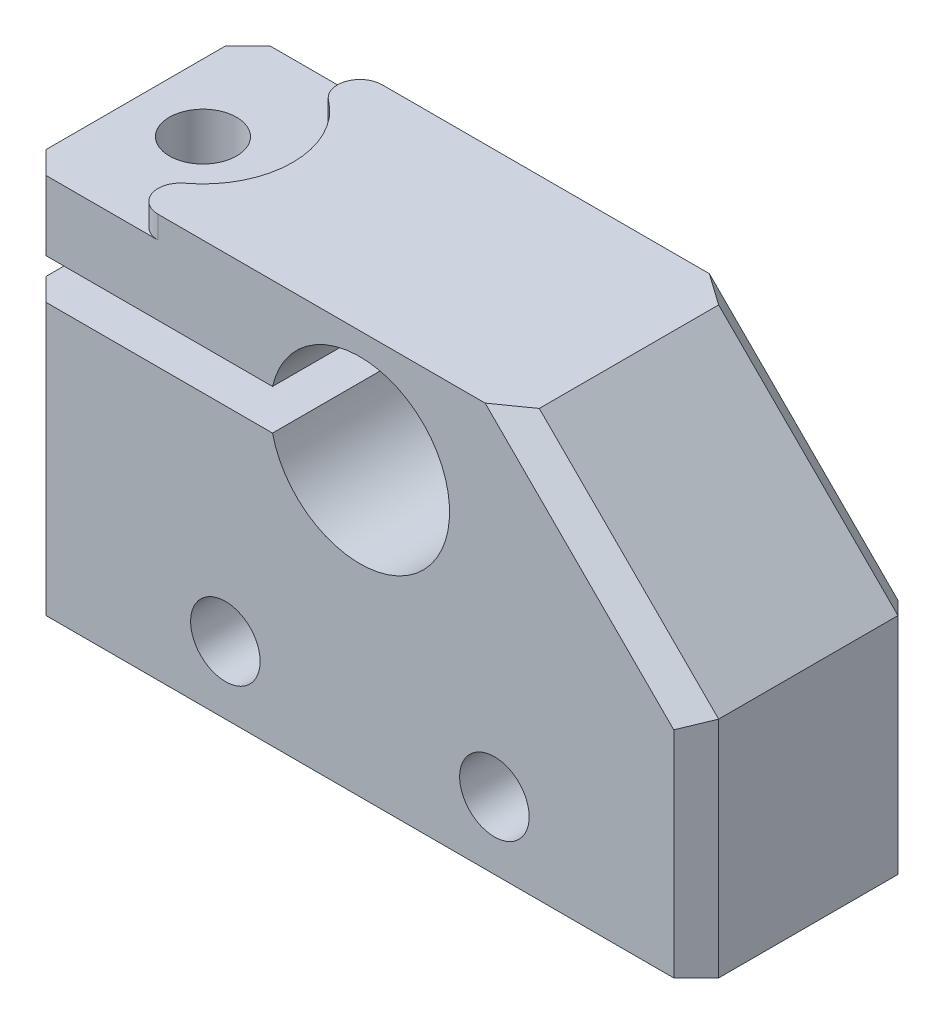
ISO-10303-21;
HEADER;
FILE_DESCRIPTION(('STEP AP214'),'2;1');
FILE_NAME('part.step','',(''),(''),'','','');
FILE_SCHEMA(('AUTOMOTIVE_DESIGN { 1 0 10303 214 1 1 1 1 }'));
ENDSEC;
DATA;
#1=APPLICATION_CONTEXT('core data for automotive mechanical design processes');
#2=APPLICATION_PROTOCOL_DEFINITION('international standard','automotive_design',2000,#1);
#3=PRODUCT_CONTEXT('',#1,'mechanical');
#4=PRODUCT('Part','Part','',(#3));
#5=PRODUCT_RELATED_PRODUCT_CATEGORY('part','',(#4));
#6=PRODUCT_DEFINITION_FORMATION('','',#4);
#7=PRODUCT_DEFINITION_CONTEXT('part definition',#1,'design');
#8=PRODUCT_DEFINITION('design','',#6,#7);
#9=PRODUCT_DEFINITION_SHAPE('','',#8);
#10=(LENGTH_UNIT() NAMED_UNIT(*) SI_UNIT(.MILLI.,.METRE.));
#11=(NAMED_UNIT(*) PLANE_ANGLE_UNIT() SI_UNIT($,.RADIAN.));
#12=(NAMED_UNIT(*) SI_UNIT($,.STERADIAN.) SOLID_ANGLE_UNIT());
#13=UNCERTAINTY_MEASURE_WITH_UNIT(LENGTH_MEASURE(1.E-05),#10,'distance_accuracy_value','');
#14=(GEOMETRIC_REPRESENTATION_CONTEXT(3) GLOBAL_UNCERTAINTY_ASSIGNED_CONTEXT((#13)) GLOBAL_UNIT_ASSIGNED_CONTEXT((#10,
#11,#12)) REPRESENTATION_CONTEXT('',''));
#15=CARTESIAN_POINT('',(0.,0.,0.));
#16=DIRECTION('',(0.,0.,1.));
#17=DIRECTION('',(1.,0.,0.));
#18=AXIS2_PLACEMENT_3D('',#15,#16,#17);
#19=CARTESIAN_POINT('',(-15.,-4.,5.));
#20=DIRECTION('',(1.,0.,0.));
#21=DIRECTION('',(0.,0.,-1.));
#22=AXIS2_PLACEMENT_3D('',#19,#20,#21);
#23=PLANE('',#22);
#24=DIRECTION('',(0.,0.,1.));
#25=VECTOR('',#24,1.);
#26=CARTESIAN_POINT('',(-15.,13.,-5.));
#27=LINE('',#26,#25);
#28=CARTESIAN_POINT('',(-15.,13.,-4.));
#29=VERTEX_POINT('',#28);
#30=CARTESIAN_POINT('',(-15.,13.,4.));
#31=VERTEX_POINT('',#30);
#32=EDGE_CURVE('E214',#29,#31,#27,.T.);
#33=ORIENTED_EDGE('',*,*,#32,.F.);
#34=DIRECTION('',(0.,-1.,0.));
#35=VECTOR('',#34,1.);
#36=CARTESIAN_POINT('',(-15.,9.9,-4.));
#37=LINE('',#36,#35);
#38=CARTESIAN_POINT('',(-15.,9.9,-4.));
#39=VERTEX_POINT('',#38);
#40=EDGE_CURVE('E334',#29,#39,#37,.T.);
#41=ORIENTED_EDGE('',*,*,#40,.T.);
#42=DIRECTION('',(0.,0.,1.));
#43=VECTOR('',#42,1.);
#44=CARTESIAN_POINT('',(-15.,9.9,-5.));
#45=LINE('',#44,#43);
#46=CARTESIAN_POINT('',(-15.,9.9,4.));
#47=VERTEX_POINT('',#46);
#48=EDGE_CURVE('E250',#39,#47,#45,.T.);
#49=ORIENTED_EDGE('',*,*,#48,.T.);
#50=DIRECTION('',(0.,1.,0.));
#51=VECTOR('',#50,1.);
#52=CARTESIAN_POINT('',(-15.,-4.,4.));
#53=LINE('',#52,#51);
#54=EDGE_CURVE('E332',#47,#31,#53,.T.);
#55=ORIENTED_EDGE('',*,*,#54,.T.);
#56=EDGE_LOOP('',(#33,#41,#49,#55));
#57=FACE_BOUND('',#56,.T.);
#58=ADVANCED_FACE('F45',(#57),#23,.F.);
#59=CARTESIAN_POINT('',(-12.,-4.00000000000001,0.));
#60=DIRECTION('',(0.,1.,0.));
#61=DIRECTION('',(-1.,0.,0.));
#62=AXIS2_PLACEMENT_3D('',#59,#60,#61);
#63=CYLINDRICAL_SURFACE('',#62,1.5);
#64=CARTESIAN_POINT('',(-12.,9.9,0.));
#65=DIRECTION('',(0.,1.,0.));
#66=DIRECTION('',(0.,0.,1.));
#67=AXIS2_PLACEMENT_3D('',#64,#65,#66);
#68=CIRCLE('',#67,1.5);
#69=CARTESIAN_POINT('',(-12.,9.9,1.5));
#70=VERTEX_POINT('',#69);
#71=EDGE_CURVE('E241',#70,#70,#68,.T.);
#72=ORIENTED_EDGE('',*,*,#71,.F.);
#73=EDGE_LOOP('',(#72));
#74=FACE_BOUND('',#73,.T.);
#75=CARTESIAN_POINT('',(-12.,13.,0.));
#76=DIRECTION('',(0.,1.,0.));
#77=DIRECTION('',(-1.,0.,0.));
#78=AXIS2_PLACEMENT_3D('',#75,#76,#77);
#79=CIRCLE('',#78,1.5);
#80=CARTESIAN_POINT('',(-13.5,13.,0.));
#81=VERTEX_POINT('',#80);
#82=EDGE_CURVE('E233',#81,#81,#79,.F.);
#83=ORIENTED_EDGE('',*,*,#82,.F.);
#84=EDGE_LOOP('',(#83));
#85=FACE_BOUND('',#84,.T.);
#86=ADVANCED_FACE('F445',(#74,#85),#63,.F.);
#87=DIRECTION('',(0.,0.,1.));
#88=VECTOR('',#87,1.);
#89=CARTESIAN_POINT('',(-15.,8.1,-5.));
#90=LINE('',#89,#88);
#91=CARTESIAN_POINT('',(-15.,8.1,-4.));
#92=VERTEX_POINT('',#91);
#93=CARTESIAN_POINT('',(-15.,8.1,4.));
#94=VERTEX_POINT('',#93);
#95=EDGE_CURVE('E251',#92,#94,#90,.T.);
#96=ORIENTED_EDGE('',*,*,#95,.F.);
#97=DIRECTION('',(0.,-1.,0.));
#98=VECTOR('',#97,1.);
#99=CARTESIAN_POINT('',(-15.,-4.,-4.));
#100=LINE('',#99,#98);
#101=CARTESIAN_POINT('',(-15.,-4.,-4.));
#102=VERTEX_POINT('',#101);
#103=EDGE_CURVE('E310',#92,#102,#100,.T.);
#104=ORIENTED_EDGE('',*,*,#103,.T.);
#105=DIRECTION('',(0.,0.,-1.));
#106=VECTOR('',#105,1.);
#107=CARTESIAN_POINT('',(-15.,-4.,5.));
#108=LINE('',#107,#106);
#109=CARTESIAN_POINT('',(-15.,-4.,4.));
#110=VERTEX_POINT('',#109);
#111=EDGE_CURVE('E296',#110,#102,#108,.T.);
#112=ORIENTED_EDGE('',*,*,#111,.F.);
#113=DIRECTION('',(0.,1.,0.));
#114=VECTOR('',#113,1.);
#115=CARTESIAN_POINT('',(-15.,-4.,4.));
#116=LINE('',#115,#114);
#117=EDGE_CURVE('E304',#110,#94,#116,.T.);
#118=ORIENTED_EDGE('',*,*,#117,.T.);
#119=EDGE_LOOP('',(#96,#104,#112,#118));
#120=FACE_BOUND('',#119,.T.);
#121=ADVANCED_FACE('F412',(#120),#23,.F.);
#122=CARTESIAN_POINT('',(0.,0.,5.));
#123=DIRECTION('',(0.,0.,-1.));
#124=DIRECTION('',(-1.,0.,0.));
#125=AXIS2_PLACEMENT_3D('',#122,#123,#124);
#126=PLANE('',#125);
#127=DIRECTION('',(1.,0.,0.));
#128=VECTOR('',#127,1.);
#129=CARTESIAN_POINT('',(-15.,13.,5.));
#130=LINE('',#129,#128);
#131=CARTESIAN_POINT('',(-14.,13.,5.));
#132=VERTEX_POINT('',#131);
#133=CARTESIAN_POINT('',(-9.,13.,5.));
#134=VERTEX_POINT('',#133);
#135=EDGE_CURVE('E217',#132,#134,#130,.T.);
#136=ORIENTED_EDGE('',*,*,#135,.F.);
#137=DIRECTION('',(0.,-1.,0.));
#138=VECTOR('',#137,1.);
#139=CARTESIAN_POINT('',(-14.,0.,5.));
#140=LINE('',#139,#138);
#141=CARTESIAN_POINT('',(-14.,9.9,5.));
#142=VERTEX_POINT('',#141);
#143=EDGE_CURVE('E353',#132,#142,#140,.T.);
#144=ORIENTED_EDGE('',*,*,#143,.T.);
#145=DIRECTION('',(1.,0.,0.));
#146=VECTOR('',#145,1.);
#147=CARTESIAN_POINT('',(0.,9.9,5.));
#148=LINE('',#147,#146);
#149=CARTESIAN_POINT('',(-3.89743505398102,9.9,5.));
#150=VERTEX_POINT('',#149);
#151=EDGE_CURVE('E258',#142,#150,#148,.T.);
#152=ORIENTED_EDGE('',*,*,#151,.T.);
#153=CARTESIAN_POINT('',(0.,9.,5.));
#154=DIRECTION('',(0.,0.,1.));
#155=DIRECTION('',(1.,0.,0.));
#156=AXIS2_PLACEMENT_3D('',#153,#154,#155);
#157=CIRCLE('',#156,4.);
#158=CARTESIAN_POINT('',(-3.89743505398102,8.1,5.));
#159=VERTEX_POINT('',#158);
#160=EDGE_CURVE('E264',#159,#150,#157,.T.);
#161=ORIENTED_EDGE('',*,*,#160,.F.);
#162=DIRECTION('',(1.,0.,0.));
#163=VECTOR('',#162,1.);
#164=CARTESIAN_POINT('',(0.,8.1,5.));
#165=LINE('',#164,#163);
#166=CARTESIAN_POINT('',(-14.,8.1,5.));
#167=VERTEX_POINT('',#166);
#168=EDGE_CURVE('E254',#167,#159,#165,.T.);
#169=ORIENTED_EDGE('',*,*,#168,.F.);
#170=DIRECTION('',(0.,-1.,0.));
#171=VECTOR('',#170,1.);
#172=CARTESIAN_POINT('',(-14.,0.,5.));
#173=LINE('',#172,#171);
#174=CARTESIAN_POINT('',(-14.,-4.,5.));
#175=VERTEX_POINT('',#174);
#176=EDGE_CURVE('E350',#167,#175,#173,.T.);
#177=ORIENTED_EDGE('',*,*,#176,.T.);
#178=DIRECTION('',(1.,0.,0.));
#179=VECTOR('',#178,1.);
#180=CARTESIAN_POINT('',(-15.,-4.,5.));
#181=LINE('',#180,#179);
#182=CARTESIAN_POINT('',(14.,-4.,5.));
#183=VERTEX_POINT('',#182);
#184=EDGE_CURVE('E288',#175,#183,#181,.T.);
#185=ORIENTED_EDGE('',*,*,#184,.T.);
#186=DIRECTION('',(0.,1.,0.));
#187=VECTOR('',#186,1.);
#188=CARTESIAN_POINT('',(14.,0.,5.));
#189=LINE('',#188,#187);
#190=CARTESIAN_POINT('',(14.,5.5857864376269,5.));
#191=VERTEX_POINT('',#190);
#192=EDGE_CURVE('E345',#183,#191,#189,.T.);
#193=ORIENTED_EDGE('',*,*,#192,.T.);
#194=DIRECTION('',(-0.707106781186551,0.707106781186544,0.));
#195=VECTOR('',#194,1.);
#196=CARTESIAN_POINT('',(6.29289321881336,13.2928932188134,5.));
#197=LINE('',#196,#195);
#198=CARTESIAN_POINT('',(5.5857864376268,14.,5.));
#199=VERTEX_POINT('',#198);
#200=EDGE_CURVE('E347',#191,#199,#197,.T.);
#201=ORIENTED_EDGE('',*,*,#200,.T.);
#202=DIRECTION('',(-1.,0.,0.));
#203=VECTOR('',#202,1.);
#204=CARTESIAN_POINT('',(6.99999999999991,14.,5.));
#205=LINE('',#204,#203);
#206=CARTESIAN_POINT('',(-9.00000000000001,14.,5.));
#207=VERTEX_POINT('',#206);
#208=EDGE_CURVE('E261',#199,#207,#205,.T.);
#209=ORIENTED_EDGE('',*,*,#208,.T.);
#210=DIRECTION('',(0.,1.,0.));
#211=VECTOR('',#210,1.);
#212=CARTESIAN_POINT('',(-9.,13.,5.));
#213=LINE('',#212,#211);
#214=EDGE_CURVE('E195',#134,#207,#213,.T.);
#215=ORIENTED_EDGE('',*,*,#214,.F.);
#216=EDGE_LOOP('',(#136,#144,#152,#161,#169,#177,#185,#193,#201,#209,#215));
#217=FACE_BOUND('',#216,.T.);
#218=CARTESIAN_POINT('',(-6.,-1.,5.));
#219=DIRECTION('',(0.,0.,1.));
#220=DIRECTION('',(1.,0.,0.));
#221=AXIS2_PLACEMENT_3D('',#218,#219,#220);
#222=CIRCLE('',#221,1.55);
#223=CARTESIAN_POINT('',(-4.45,-1.,5.));
#224=VERTEX_POINT('',#223);
#225=EDGE_CURVE('E282',#224,#224,#222,.T.);
#226=ORIENTED_EDGE('',*,*,#225,.F.);
#227=EDGE_LOOP('',(#226));
#228=FACE_BOUND('',#227,.T.);
#229=CARTESIAN_POINT('',(6.,-0.999999999999999,5.));
#230=DIRECTION('',(0.,0.,1.));
#231=DIRECTION('',(1.,0.,0.));
#232=AXIS2_PLACEMENT_3D('',#229,#230,#231);
#233=CIRCLE('',#232,1.55);
#234=CARTESIAN_POINT('',(7.55,-0.999999999999999,5.));
#235=VERTEX_POINT('',#234);
#236=EDGE_CURVE('E276',#235,#235,#233,.T.);
#237=ORIENTED_EDGE('',*,*,#236,.F.);
#238=EDGE_LOOP('',(#237));
#239=FACE_BOUND('',#238,.T.);
#240=ADVANCED_FACE('F402',(#217,#228,#239),#126,.F.);
#241=CARTESIAN_POINT('',(0.,0.,-5.));
#242=DIRECTION('',(0.,0.,-1.));
#243=DIRECTION('',(-1.,0.,0.));
#244=AXIS2_PLACEMENT_3D('',#241,#242,#243);
#245=PLANE('',#244);
#246=DIRECTION('',(1.,0.,0.));
#247=VECTOR('',#246,1.);
#248=CARTESIAN_POINT('',(-15.,-4.,-5.));
#249=LINE('',#248,#247);
#250=CARTESIAN_POINT('',(-14.,-4.,-5.));
#251=VERTEX_POINT('',#250);
#252=CARTESIAN_POINT('',(14.,-4.,-5.));
#253=VERTEX_POINT('',#252);
#254=EDGE_CURVE('E285',#251,#253,#249,.T.);
#255=ORIENTED_EDGE('',*,*,#254,.F.);
#256=DIRECTION('',(0.,1.,0.));
#257=VECTOR('',#256,1.);
#258=CARTESIAN_POINT('',(-14.,8.1,-5.));
#259=LINE('',#258,#257);
#260=CARTESIAN_POINT('',(-14.,8.1,-5.));
#261=VERTEX_POINT('',#260);
#262=EDGE_CURVE('E326',#251,#261,#259,.T.);
#263=ORIENTED_EDGE('',*,*,#262,.T.);
#264=DIRECTION('',(1.,0.,0.));
#265=VECTOR('',#264,1.);
#266=CARTESIAN_POINT('',(0.,8.1,-5.));
#267=LINE('',#266,#265);
#268=CARTESIAN_POINT('',(-3.89743505398102,8.1,-5.));
#269=VERTEX_POINT('',#268);
#270=EDGE_CURVE('E247',#269,#261,#267,.F.);
#271=ORIENTED_EDGE('',*,*,#270,.F.);
#272=CARTESIAN_POINT('',(0.,9.,-5.));
#273=DIRECTION('',(0.,0.,-1.));
#274=DIRECTION('',(-1.,0.,0.));
#275=AXIS2_PLACEMENT_3D('',#272,#273,#274);
#276=CIRCLE('',#275,4.);
#277=CARTESIAN_POINT('',(-3.89743505398102,9.9,-5.));
#278=VERTEX_POINT('',#277);
#279=EDGE_CURVE('E263',#269,#278,#276,.F.);
#280=ORIENTED_EDGE('',*,*,#279,.T.);
#281=DIRECTION('',(1.,0.,0.));
#282=VECTOR('',#281,1.);
#283=CARTESIAN_POINT('',(0.,9.9,-5.));
#284=LINE('',#283,#282);
#285=CARTESIAN_POINT('',(-14.,9.9,-5.));
#286=VERTEX_POINT('',#285);
#287=EDGE_CURVE('E245',#278,#286,#284,.F.);
#288=ORIENTED_EDGE('',*,*,#287,.T.);
#289=DIRECTION('',(0.,1.,0.));
#290=VECTOR('',#289,1.);
#291=CARTESIAN_POINT('',(-14.,13.,-5.));
#292=LINE('',#291,#290);
#293=CARTESIAN_POINT('',(-14.,13.,-5.));
#294=VERTEX_POINT('',#293);
#295=EDGE_CURVE('E213',#286,#294,#292,.T.);
#296=ORIENTED_EDGE('',*,*,#295,.T.);
#297=DIRECTION('',(-1.,0.,0.));
#298=VECTOR('',#297,1.);
#299=CARTESIAN_POINT('',(-9.,13.,-5.));
#300=LINE('',#299,#298);
#301=CARTESIAN_POINT('',(-9.,13.,-5.));
#302=VERTEX_POINT('',#301);
#303=EDGE_CURVE('E202',#302,#294,#300,.T.);
#304=ORIENTED_EDGE('',*,*,#303,.F.);
#305=DIRECTION('',(0.,1.,0.));
#306=VECTOR('',#305,1.);
#307=CARTESIAN_POINT('',(-9.,13.,-5.));
#308=LINE('',#307,#306);
#309=CARTESIAN_POINT('',(-9.,14.,-5.));
#310=VERTEX_POINT('',#309);
#311=EDGE_CURVE('E185',#302,#310,#308,.T.);
#312=ORIENTED_EDGE('',*,*,#311,.T.);
#313=DIRECTION('',(-1.,0.,0.));
#314=VECTOR('',#313,1.);
#315=CARTESIAN_POINT('',(6.99999999999991,14.,-5.));
#316=LINE('',#315,#314);
#317=CARTESIAN_POINT('',(5.5857864376268,14.,-5.));
#318=VERTEX_POINT('',#317);
#319=EDGE_CURVE('E260',#318,#310,#316,.T.);
#320=ORIENTED_EDGE('',*,*,#319,.F.);
#321=DIRECTION('',(0.707106781186551,-0.707106781186544,0.));
#322=VECTOR('',#321,1.);
#323=CARTESIAN_POINT('',(9.79289321881337,9.79289321881348,-5.));
#324=LINE('',#323,#322);
#325=CARTESIAN_POINT('',(14.,5.58578643762691,-5.));
#326=VERTEX_POINT('',#325);
#327=EDGE_CURVE('E321',#318,#326,#324,.T.);
#328=ORIENTED_EDGE('',*,*,#327,.T.);
#329=DIRECTION('',(0.,-1.,0.));
#330=VECTOR('',#329,1.);
#331=CARTESIAN_POINT('',(14.,-4.,-5.));
#332=LINE('',#331,#330);
#333=EDGE_CURVE('E323',#326,#253,#332,.T.);
#334=ORIENTED_EDGE('',*,*,#333,.T.);
#335=EDGE_LOOP('',(#255,#263,#271,#280,#288,#296,#304,#312,#320,#328,#334));
#336=FACE_BOUND('',#335,.T.);
#337=CARTESIAN_POINT('',(-6.,-1.,-5.));
#338=DIRECTION('',(0.,0.,1.));
#339=DIRECTION('',(1.,0.,0.));
#340=AXIS2_PLACEMENT_3D('',#337,#338,#339);
#341=CIRCLE('',#340,1.55);
#342=CARTESIAN_POINT('',(-4.45,-1.,-5.));
#343=VERTEX_POINT('',#342);
#344=EDGE_CURVE('E279',#343,#343,#341,.T.);
#345=ORIENTED_EDGE('',*,*,#344,.T.);
#346=EDGE_LOOP('',(#345));
#347=FACE_BOUND('',#346,.T.);
#348=CARTESIAN_POINT('',(6.,-0.999999999999999,-5.));
#349=DIRECTION('',(0.,0.,1.));
#350=DIRECTION('',(1.,0.,0.));
#351=AXIS2_PLACEMENT_3D('',#348,#349,#350);
#352=CIRCLE('',#351,1.55);
#353=CARTESIAN_POINT('',(7.55,-0.999999999999999,-5.));
#354=VERTEX_POINT('',#353);
#355=EDGE_CURVE('E270',#354,#354,#352,.T.);
#356=ORIENTED_EDGE('',*,*,#355,.T.);
#357=EDGE_LOOP('',(#356));
#358=FACE_BOUND('',#357,.T.);
#359=ADVANCED_FACE('F209',(#336,#347,#358),#245,.T.);
#360=CARTESIAN_POINT('',(15.,-4.,5.));
#361=DIRECTION('',(-1.,0.,0.));
#362=DIRECTION('',(0.,0.,1.));
#363=AXIS2_PLACEMENT_3D('',#360,#361,#362);
#364=PLANE('',#363);
#365=DIRECTION('',(0.,0.,-1.));
#366=VECTOR('',#365,1.);
#367=CARTESIAN_POINT('',(15.,-4.,5.));
#368=LINE('',#367,#366);
#369=CARTESIAN_POINT('',(15.,-4.,3.99999999999999));
#370=VERTEX_POINT('',#369);
#371=CARTESIAN_POINT('',(15.,-4.,-4.));
#372=VERTEX_POINT('',#371);
#373=EDGE_CURVE('E291',#370,#372,#368,.T.);
#374=ORIENTED_EDGE('',*,*,#373,.T.);
#375=DIRECTION('',(0.,1.,0.));
#376=VECTOR('',#375,1.);
#377=CARTESIAN_POINT('',(15.,6.,-4.));
#378=LINE('',#377,#376);
#379=CARTESIAN_POINT('',(15.,6.,-4.));
#380=VERTEX_POINT('',#379);
#381=EDGE_CURVE('E358',#372,#380,#378,.T.);
#382=ORIENTED_EDGE('',*,*,#381,.T.);
#383=DIRECTION('',(0.,0.,1.));
#384=VECTOR('',#383,1.);
#385=CARTESIAN_POINT('',(15.,6.,-36.6227766016838));
#386=LINE('',#385,#384);
#387=CARTESIAN_POINT('',(15.,6.,3.99999999999999));
#388=VERTEX_POINT('',#387);
#389=EDGE_CURVE('E267',#380,#388,#386,.T.);
#390=ORIENTED_EDGE('',*,*,#389,.T.);
#391=DIRECTION('',(0.,-1.,0.));
#392=VECTOR('',#391,1.);
#393=CARTESIAN_POINT('',(15.,-4.,3.99999999999999));
#394=LINE('',#393,#392);
#395=EDGE_CURVE('E356',#388,#370,#394,.T.);
#396=ORIENTED_EDGE('',*,*,#395,.T.);
#397=EDGE_LOOP('',(#374,#382,#390,#396));
#398=FACE_BOUND('',#397,.T.);
#399=ADVANCED_FACE('F380',(#398),#364,.F.);
#400=CARTESIAN_POINT('',(-15.,-4.,5.));
#401=DIRECTION('',(0.,1.,0.));
#402=DIRECTION('',(0.,0.,1.));
#403=AXIS2_PLACEMENT_3D('',#400,#401,#402);
#404=PLANE('',#403);
#405=CARTESIAN_POINT('',(-12.,-4.00000000000001,0.));
#406=DIRECTION('',(0.,1.,0.));
#407=DIRECTION('',(-1.,0.,0.));
#408=AXIS2_PLACEMENT_3D('',#405,#406,#407);
#409=CIRCLE('',#408,1.5);
#410=CARTESIAN_POINT('',(-13.5,-4.00000000000001,0.));
#411=VERTEX_POINT('',#410);
#412=EDGE_CURVE('E238',#411,#411,#409,.T.);
#413=ORIENTED_EDGE('',*,*,#412,.T.);
#414=EDGE_LOOP('',(#413));
#415=FACE_BOUND('',#414,.T.);
#416=ORIENTED_EDGE('',*,*,#111,.T.);
#417=DIRECTION('',(0.707106781186549,0.,-0.707106781186546));
#418=VECTOR('',#417,1.);
#419=CARTESIAN_POINT('',(-15.,-4.,-4.));
#420=LINE('',#419,#418);
#421=EDGE_CURVE('E319',#102,#251,#420,.T.);
#422=ORIENTED_EDGE('',*,*,#421,.T.);
#423=ORIENTED_EDGE('',*,*,#254,.T.);
#424=DIRECTION('',(0.707106781186549,0.,0.707106781186546));
#425=VECTOR('',#424,1.);
#426=CARTESIAN_POINT('',(15.,-4.,-4.));
#427=LINE('',#426,#425);
#428=EDGE_CURVE('E315',#253,#372,#427,.T.);
#429=ORIENTED_EDGE('',*,*,#428,.T.);
#430=ORIENTED_EDGE('',*,*,#373,.F.);
#431=DIRECTION('',(0.707106781186546,0.,-0.707106781186549));
#432=VECTOR('',#431,1.);
#433=CARTESIAN_POINT('',(14.,-4.,5.));
#434=LINE('',#433,#432);
#435=EDGE_CURVE('E313',#370,#183,#434,.F.);
#436=ORIENTED_EDGE('',*,*,#435,.T.);
#437=ORIENTED_EDGE('',*,*,#184,.F.);
#438=DIRECTION('',(0.707106781186548,0.,0.707106781186548));
#439=VECTOR('',#438,1.);
#440=CARTESIAN_POINT('',(-14.,-4.,5.));
#441=LINE('',#440,#439);
#442=EDGE_CURVE('E317',#175,#110,#441,.F.);
#443=ORIENTED_EDGE('',*,*,#442,.T.);
#444=EDGE_LOOP('',(#416,#422,#423,#429,#430,#436,#437,#443));
#445=FACE_BOUND('',#444,.T.);
#446=ADVANCED_FACE('F382',(#415,#445),#404,.F.);
#447=CARTESIAN_POINT('',(-6.,-1.,5.));
#448=DIRECTION('',(0.,0.,-1.));
#449=DIRECTION('',(-1.,0.,0.));
#450=AXIS2_PLACEMENT_3D('',#447,#448,#449);
#451=CYLINDRICAL_SURFACE('',#450,1.55);
#452=ORIENTED_EDGE('',*,*,#225,.T.);
#453=EDGE_LOOP('',(#452));
#454=FACE_BOUND('',#453,.T.);
#455=ORIENTED_EDGE('',*,*,#344,.F.);
#456=EDGE_LOOP('',(#455));
#457=FACE_BOUND('',#456,.T.);
#458=ADVANCED_FACE('F466',(#454,#457),#451,.F.);
#459=CARTESIAN_POINT('',(6.,-0.999999999999999,5.));
#460=DIRECTION('',(0.,0.,-1.));
#461=DIRECTION('',(-1.,0.,0.));
#462=AXIS2_PLACEMENT_3D('',#459,#460,#461);
#463=CYLINDRICAL_SURFACE('',#462,1.55);
#464=ORIENTED_EDGE('',*,*,#236,.T.);
#465=EDGE_LOOP('',(#464));
#466=FACE_BOUND('',#465,.T.);
#467=ORIENTED_EDGE('',*,*,#355,.F.);
#468=EDGE_LOOP('',(#467));
#469=FACE_BOUND('',#468,.T.);
#470=ADVANCED_FACE('F475',(#466,#469),#463,.F.);
#471=CARTESIAN_POINT('',(6.99999999999991,14.,-36.6227766016838));
#472=DIRECTION('',(0.,1.,0.));
#473=DIRECTION('',(-1.,0.,0.));
#474=AXIS2_PLACEMENT_3D('',#471,#472,#473);
#475=PLANE('',#474);
#476=DIRECTION('',(0.,0.,1.));
#477=VECTOR('',#476,1.);
#478=CARTESIAN_POINT('',(6.99999999999991,14.,-36.6227766016838));
#479=LINE('',#478,#477);
#480=CARTESIAN_POINT('',(6.99999999999991,14.,-4.));
#481=VERTEX_POINT('',#480);
#482=CARTESIAN_POINT('',(6.99999999999991,14.,3.99999999999999));
#483=VERTEX_POINT('',#482);
#484=EDGE_CURVE('E272',#481,#483,#479,.T.);
#485=ORIENTED_EDGE('',*,*,#484,.F.);
#486=DIRECTION('',(0.816496580927729,0.,0.577350269189622));
#487=VECTOR('',#486,1.);
#488=CARTESIAN_POINT('',(-8.37852437078967,14.,-14.8742588672278));
#489=LINE('',#488,#487);
#490=EDGE_CURVE('E11',#481,#318,#489,.F.);
#491=ORIENTED_EDGE('',*,*,#490,.T.);
#492=ORIENTED_EDGE('',*,*,#319,.T.);
#493=CARTESIAN_POINT('',(-9.,14.,-4.));
#494=DIRECTION('',(0.,-1.,0.));
#495=DIRECTION('',(-1.,0.,0.));
#496=AXIS2_PLACEMENT_3D('',#493,#494,#495);
#497=CIRCLE('',#496,1.);
#498=CARTESIAN_POINT('',(-9.6,14.,-3.2));
#499=VERTEX_POINT('',#498);
#500=EDGE_CURVE('E191',#499,#310,#497,.T.);
#501=ORIENTED_EDGE('',*,*,#500,.F.);
#502=CARTESIAN_POINT('',(-12.,14.,0.));
#503=DIRECTION('',(0.,1.,0.));
#504=DIRECTION('',(1.,0.,0.));
#505=AXIS2_PLACEMENT_3D('',#502,#503,#504);
#506=CIRCLE('',#505,4.);
#507=CARTESIAN_POINT('',(-9.6,14.,3.2));
#508=VERTEX_POINT('',#507);
#509=EDGE_CURVE('E206',#508,#499,#506,.T.);
#510=ORIENTED_EDGE('',*,*,#509,.F.);
#511=CARTESIAN_POINT('',(-9.,14.,4.));
#512=DIRECTION('',(0.,-1.,0.));
#513=DIRECTION('',(-1.,0.,0.));
#514=AXIS2_PLACEMENT_3D('',#511,#512,#513);
#515=CIRCLE('',#514,1.);
#516=EDGE_CURVE('E225',#207,#508,#515,.T.);
#517=ORIENTED_EDGE('',*,*,#516,.F.);
#518=ORIENTED_EDGE('',*,*,#208,.F.);
#519=DIRECTION('',(0.816496580927726,0.,-0.577350269189626));
#520=VECTOR('',#519,1.);
#521=CARTESIAN_POINT('',(26.1497605371178,14.,-9.54092553389462));
#522=LINE('',#521,#520);
#523=EDGE_CURVE('E55',#199,#483,#522,.T.);
#524=ORIENTED_EDGE('',*,*,#523,.T.);
#525=EDGE_LOOP('',(#485,#491,#492,#501,#510,#517,#518,#524));
#526=FACE_BOUND('',#525,.T.);
#527=ADVANCED_FACE('F388',(#526),#475,.T.);
#528=CARTESIAN_POINT('',(15.,6.,-36.6227766016838));
#529=DIRECTION('',(0.707106781186544,0.707106781186551,0.));
#530=DIRECTION('',(-0.707106781186551,0.707106781186544,0.));
#531=AXIS2_PLACEMENT_3D('',#528,#529,#530);
#532=PLANE('',#531);
#533=ORIENTED_EDGE('',*,*,#389,.F.);
#534=DIRECTION('',(-0.707106781186551,0.707106781186544,0.));
#535=VECTOR('',#534,1.);
#536=CARTESIAN_POINT('',(15.,6.,-4.));
#537=LINE('',#536,#535);
#538=EDGE_CURVE('E69',#380,#481,#537,.T.);
#539=ORIENTED_EDGE('',*,*,#538,.T.);
#540=ORIENTED_EDGE('',*,*,#484,.T.);
#541=DIRECTION('',(0.707106781186551,-0.707106781186544,0.));
#542=VECTOR('',#541,1.);
#543=CARTESIAN_POINT('',(15.,6.,3.99999999999999));
#544=LINE('',#543,#542);
#545=EDGE_CURVE('E361',#483,#388,#544,.T.);
#546=ORIENTED_EDGE('',*,*,#545,.T.);
#547=EDGE_LOOP('',(#533,#539,#540,#546));
#548=FACE_BOUND('',#547,.T.);
#549=ADVANCED_FACE('F386',(#548),#532,.T.);
#550=CARTESIAN_POINT('',(0.,9.,-36.6227766016838));
#551=DIRECTION('',(0.,0.,1.));
#552=DIRECTION('',(1.,0.,0.));
#553=AXIS2_PLACEMENT_3D('',#550,#551,#552);
#554=CYLINDRICAL_SURFACE('',#553,4.);
#555=ORIENTED_EDGE('',*,*,#160,.T.);
#556=DIRECTION('',(0.,0.,1.));
#557=VECTOR('',#556,1.);
#558=CARTESIAN_POINT('',(-3.89743505398102,9.9,-36.6227766016838));
#559=LINE('',#558,#557);
#560=EDGE_CURVE('E301',#150,#278,#559,.F.);
#561=ORIENTED_EDGE('',*,*,#560,.T.);
#562=ORIENTED_EDGE('',*,*,#279,.F.);
#563=DIRECTION('',(0.,0.,1.));
#564=VECTOR('',#563,1.);
#565=CARTESIAN_POINT('',(-3.89743505398102,8.1,-36.6227766016838));
#566=LINE('',#565,#564);
#567=EDGE_CURVE('E299',#159,#269,#566,.F.);
#568=ORIENTED_EDGE('',*,*,#567,.F.);
#569=EDGE_LOOP('',(#555,#561,#562,#568));
#570=FACE_BOUND('',#569,.T.);
#571=ADVANCED_FACE('F423',(#570),#554,.F.);
#572=CARTESIAN_POINT('',(0.,8.1,-5.));
#573=DIRECTION('',(0.,1.,0.));
#574=DIRECTION('',(0.,0.,1.));
#575=AXIS2_PLACEMENT_3D('',#572,#573,#574);
#576=PLANE('',#575);
#577=CARTESIAN_POINT('',(-12.,8.1,0.));
#578=DIRECTION('',(0.,1.,0.));
#579=DIRECTION('',(0.,0.,1.));
#580=AXIS2_PLACEMENT_3D('',#577,#578,#579);
#581=CIRCLE('',#580,1.5);
#582=CARTESIAN_POINT('',(-12.,8.1,1.5));
#583=VERTEX_POINT('',#582);
#584=EDGE_CURVE('E242',#583,#583,#581,.T.);
#585=ORIENTED_EDGE('',*,*,#584,.F.);
#586=EDGE_LOOP('',(#585));
#587=FACE_BOUND('',#586,.T.);
#588=ORIENTED_EDGE('',*,*,#270,.T.);
#589=DIRECTION('',(-0.707106781186549,0.,0.707106781186546));
#590=VECTOR('',#589,1.);
#591=CARTESIAN_POINT('',(-6.99999999999997,8.1,-12.));
#592=LINE('',#591,#590);
#593=EDGE_CURVE('E330',#261,#92,#592,.T.);
#594=ORIENTED_EDGE('',*,*,#593,.T.);
#595=ORIENTED_EDGE('',*,*,#95,.T.);
#596=DIRECTION('',(-0.707106781186548,0.,-0.707106781186548));
#597=VECTOR('',#596,1.);
#598=CARTESIAN_POINT('',(-12.,8.1,7.));
#599=LINE('',#598,#597);
#600=EDGE_CURVE('E328',#94,#167,#599,.F.);
#601=ORIENTED_EDGE('',*,*,#600,.T.);
#602=ORIENTED_EDGE('',*,*,#168,.T.);
#603=ORIENTED_EDGE('',*,*,#567,.T.);
#604=EDGE_LOOP('',(#588,#594,#595,#601,#602,#603));
#605=FACE_BOUND('',#604,.T.);
#606=ADVANCED_FACE('F417',(#587,#605),#576,.T.);
#607=CARTESIAN_POINT('',(0.,9.9,-5.));
#608=DIRECTION('',(0.,1.,0.));
#609=DIRECTION('',(0.,0.,1.));
#610=AXIS2_PLACEMENT_3D('',#607,#608,#609);
#611=PLANE('',#610);
#612=ORIENTED_EDGE('',*,*,#71,.T.);
#613=EDGE_LOOP('',(#612));
#614=FACE_BOUND('',#613,.T.);
#615=ORIENTED_EDGE('',*,*,#48,.F.);
#616=DIRECTION('',(0.707106781186549,0.,-0.707106781186546));
#617=VECTOR('',#616,1.);
#618=CARTESIAN_POINT('',(-15.,9.9,-4.));
#619=LINE('',#618,#617);
#620=EDGE_CURVE('E339',#39,#286,#619,.T.);
#621=ORIENTED_EDGE('',*,*,#620,.T.);
#622=ORIENTED_EDGE('',*,*,#287,.F.);
#623=ORIENTED_EDGE('',*,*,#560,.F.);
#624=ORIENTED_EDGE('',*,*,#151,.F.);
#625=DIRECTION('',(0.707106781186548,0.,0.707106781186548));
#626=VECTOR('',#625,1.);
#627=CARTESIAN_POINT('',(-14.,9.9,5.));
#628=LINE('',#627,#626);
#629=EDGE_CURVE('E337',#142,#47,#628,.F.);
#630=ORIENTED_EDGE('',*,*,#629,.T.);
#631=EDGE_LOOP('',(#615,#621,#622,#623,#624,#630));
#632=FACE_BOUND('',#631,.T.);
#633=ADVANCED_FACE('F480',(#614,#632),#611,.F.);
#634=ORIENTED_EDGE('',*,*,#584,.T.);
#635=EDGE_LOOP('',(#634));
#636=FACE_BOUND('',#635,.T.);
#637=ORIENTED_EDGE('',*,*,#412,.F.);
#638=EDGE_LOOP('',(#637));
#639=FACE_BOUND('',#638,.T.);
#640=ADVANCED_FACE('F454',(#636,#639),#63,.F.);
#641=CARTESIAN_POINT('',(-9.,13.,-4.));
#642=DIRECTION('',(0.,1.,0.));
#643=DIRECTION('',(-1.,0.,0.));
#644=AXIS2_PLACEMENT_3D('',#641,#642,#643);
#645=PLANE('',#644);
#646=ORIENTED_EDGE('',*,*,#303,.T.);
#647=DIRECTION('',(-0.707106781186549,0.,0.707106781186546));
#648=VECTOR('',#647,1.);
#649=CARTESIAN_POINT('',(-12.,13.,-7.));
#650=LINE('',#649,#648);
#651=EDGE_CURVE('E343',#294,#29,#650,.T.);
#652=ORIENTED_EDGE('',*,*,#651,.T.);
#653=ORIENTED_EDGE('',*,*,#32,.T.);
#654=DIRECTION('',(-0.707106781186548,0.,-0.707106781186548));
#655=VECTOR('',#654,1.);
#656=CARTESIAN_POINT('',(-16.,13.,3.));
#657=LINE('',#656,#655);
#658=EDGE_CURVE('E341',#31,#132,#657,.F.);
#659=ORIENTED_EDGE('',*,*,#658,.T.);
#660=ORIENTED_EDGE('',*,*,#135,.T.);
#661=CARTESIAN_POINT('',(-9.,13.,4.));
#662=DIRECTION('',(0.,-1.,0.));
#663=DIRECTION('',(-1.,0.,0.));
#664=AXIS2_PLACEMENT_3D('',#661,#662,#663);
#665=CIRCLE('',#664,1.);
#666=CARTESIAN_POINT('',(-9.6,13.,3.2));
#667=VERTEX_POINT('',#666);
#668=EDGE_CURVE('E221',#134,#667,#665,.T.);
#669=ORIENTED_EDGE('',*,*,#668,.T.);
#670=CARTESIAN_POINT('',(-12.,13.,0.));
#671=DIRECTION('',(0.,1.,0.));
#672=DIRECTION('',(1.,0.,0.));
#673=AXIS2_PLACEMENT_3D('',#670,#671,#672);
#674=CIRCLE('',#673,4.);
#675=CARTESIAN_POINT('',(-9.6,13.,-3.2));
#676=VERTEX_POINT('',#675);
#677=EDGE_CURVE('E196',#667,#676,#674,.T.);
#678=ORIENTED_EDGE('',*,*,#677,.T.);
#679=CARTESIAN_POINT('',(-9.,13.,-4.));
#680=DIRECTION('',(0.,-1.,0.));
#681=DIRECTION('',(-1.,0.,0.));
#682=AXIS2_PLACEMENT_3D('',#679,#680,#681);
#683=CIRCLE('',#682,1.);
#684=EDGE_CURVE('E188',#676,#302,#683,.T.);
#685=ORIENTED_EDGE('',*,*,#684,.T.);
#686=EDGE_LOOP('',(#646,#652,#653,#659,#660,#669,#678,#685));
#687=FACE_BOUND('',#686,.T.);
#688=ORIENTED_EDGE('',*,*,#82,.T.);
#689=EDGE_LOOP('',(#688));
#690=FACE_BOUND('',#689,.T.);
#691=ADVANCED_FACE('F200',(#687,#690),#645,.T.);
#692=CARTESIAN_POINT('',(-9.,13.,-4.));
#693=DIRECTION('',(0.,1.,0.));
#694=DIRECTION('',(-1.,0.,0.));
#695=AXIS2_PLACEMENT_3D('',#692,#693,#694);
#696=CYLINDRICAL_SURFACE('',#695,1.);
#697=ORIENTED_EDGE('',*,*,#500,.T.);
#698=ORIENTED_EDGE('',*,*,#311,.F.);
#699=ORIENTED_EDGE('',*,*,#684,.F.);
#700=DIRECTION('',(0.,1.,0.));
#701=VECTOR('',#700,1.);
#702=CARTESIAN_POINT('',(-9.6,13.,-3.2));
#703=LINE('',#702,#701);
#704=EDGE_CURVE('E231',#676,#499,#703,.T.);
#705=ORIENTED_EDGE('',*,*,#704,.T.);
#706=EDGE_LOOP('',(#697,#698,#699,#705));
#707=FACE_BOUND('',#706,.T.);
#708=ADVANCED_FACE('F187',(#707),#696,.T.);
#709=CARTESIAN_POINT('',(-12.,13.,0.));
#710=DIRECTION('',(0.,1.,0.));
#711=DIRECTION('',(-1.,0.,0.));
#712=AXIS2_PLACEMENT_3D('',#709,#710,#711);
#713=CYLINDRICAL_SURFACE('',#712,4.);
#714=ORIENTED_EDGE('',*,*,#509,.T.);
#715=ORIENTED_EDGE('',*,*,#704,.F.);
#716=ORIENTED_EDGE('',*,*,#677,.F.);
#717=DIRECTION('',(0.,1.,0.));
#718=VECTOR('',#717,1.);
#719=CARTESIAN_POINT('',(-9.6,13.,3.2));
#720=LINE('',#719,#718);
#721=EDGE_CURVE('E234',#667,#508,#720,.T.);
#722=ORIENTED_EDGE('',*,*,#721,.T.);
#723=EDGE_LOOP('',(#714,#715,#716,#722));
#724=FACE_BOUND('',#723,.T.);
#725=ADVANCED_FACE('F395',(#724),#713,.F.);
#726=CARTESIAN_POINT('',(-9.,13.,4.));
#727=DIRECTION('',(0.,1.,0.));
#728=DIRECTION('',(-1.,0.,0.));
#729=AXIS2_PLACEMENT_3D('',#726,#727,#728);
#730=CYLINDRICAL_SURFACE('',#729,1.);
#731=ORIENTED_EDGE('',*,*,#516,.T.);
#732=ORIENTED_EDGE('',*,*,#721,.F.);
#733=ORIENTED_EDGE('',*,*,#668,.F.);
#734=ORIENTED_EDGE('',*,*,#214,.T.);
#735=EDGE_LOOP('',(#731,#732,#733,#734));
#736=FACE_BOUND('',#735,.T.);
#737=ADVANCED_FACE('F398',(#736),#730,.T.);
#738=CARTESIAN_POINT('',(-15.,-4.,-4.));
#739=DIRECTION('',(-0.707106781186546,0.,-0.707106781186549));
#740=DIRECTION('',(0.,1.,0.));
#741=AXIS2_PLACEMENT_3D('',#738,#739,#740);
#742=PLANE('',#741);
#743=ORIENTED_EDGE('',*,*,#593,.F.);
#744=ORIENTED_EDGE('',*,*,#262,.F.);
#745=ORIENTED_EDGE('',*,*,#421,.F.);
#746=ORIENTED_EDGE('',*,*,#103,.F.);
#747=EDGE_LOOP('',(#743,#744,#745,#746));
#748=FACE_BOUND('',#747,.T.);
#749=ADVANCED_FACE('F429',(#748),#742,.T.);
#750=CARTESIAN_POINT('',(-15.,-4.,-4.));
#751=DIRECTION('',(-0.707106781186546,0.,-0.707106781186549));
#752=DIRECTION('',(0.,1.,0.));
#753=AXIS2_PLACEMENT_3D('',#750,#751,#752);
#754=PLANE('',#753);
#755=ORIENTED_EDGE('',*,*,#651,.F.);
#756=ORIENTED_EDGE('',*,*,#295,.F.);
#757=ORIENTED_EDGE('',*,*,#620,.F.);
#758=ORIENTED_EDGE('',*,*,#40,.F.);
#759=EDGE_LOOP('',(#755,#756,#757,#758));
#760=FACE_BOUND('',#759,.T.);
#761=ADVANCED_FACE('F431',(#760),#754,.T.);
#762=CARTESIAN_POINT('',(-14.,0.,5.));
#763=DIRECTION('',(0.707106781186547,0.,-0.707106781186547));
#764=DIRECTION('',(0.,-1.,0.));
#765=AXIS2_PLACEMENT_3D('',#762,#763,#764);
#766=PLANE('',#765);
#767=ORIENTED_EDGE('',*,*,#658,.F.);
#768=ORIENTED_EDGE('',*,*,#54,.F.);
#769=ORIENTED_EDGE('',*,*,#629,.F.);
#770=ORIENTED_EDGE('',*,*,#143,.F.);
#771=EDGE_LOOP('',(#767,#768,#769,#770));
#772=FACE_BOUND('',#771,.T.);
#773=ADVANCED_FACE('F437',(#772),#766,.F.);
#774=CARTESIAN_POINT('',(-14.,0.,5.));
#775=DIRECTION('',(0.707106781186547,0.,-0.707106781186547));
#776=DIRECTION('',(0.,-1.,0.));
#777=AXIS2_PLACEMENT_3D('',#774,#775,#776);
#778=PLANE('',#777);
#779=ORIENTED_EDGE('',*,*,#600,.F.);
#780=ORIENTED_EDGE('',*,*,#117,.F.);
#781=ORIENTED_EDGE('',*,*,#442,.F.);
#782=ORIENTED_EDGE('',*,*,#176,.F.);
#783=EDGE_LOOP('',(#779,#780,#781,#782));
#784=FACE_BOUND('',#783,.T.);
#785=ADVANCED_FACE('F415',(#784),#778,.F.);
#786=CARTESIAN_POINT('',(15.,6.,-4.));
#787=DIRECTION('',(-0.499999999999996,-0.500000000000002,0.707106781186549));
#788=DIRECTION('',(-0.707106781186551,0.707106781186544,0.));
#789=AXIS2_PLACEMENT_3D('',#786,#787,#788);
#790=PLANE('',#789);
#791=ORIENTED_EDGE('',*,*,#490,.F.);
#792=ORIENTED_EDGE('',*,*,#538,.F.);
#793=DIRECTION('',(0.678598344545848,0.281084637714823,0.678598344545845));
#794=VECTOR('',#793,1.);
#795=CARTESIAN_POINT('',(15.,6.,-4.));
#796=LINE('',#795,#794);
#797=EDGE_CURVE('E226',#326,#380,#796,.T.);
#798=ORIENTED_EDGE('',*,*,#797,.F.);
#799=ORIENTED_EDGE('',*,*,#327,.F.);
#800=EDGE_LOOP('',(#791,#792,#798,#799));
#801=FACE_BOUND('',#800,.T.);
#802=ADVANCED_FACE('F391',(#801),#790,.F.);
#803=CARTESIAN_POINT('',(15.,-4.,-4.));
#804=DIRECTION('',(0.707106781186546,0.,-0.707106781186549));
#805=DIRECTION('',(0.,-1.,0.));
#806=AXIS2_PLACEMENT_3D('',#803,#804,#805);
#807=PLANE('',#806);
#808=ORIENTED_EDGE('',*,*,#428,.F.);
#809=ORIENTED_EDGE('',*,*,#333,.F.);
#810=ORIENTED_EDGE('',*,*,#797,.T.);
#811=ORIENTED_EDGE('',*,*,#381,.F.);
#812=EDGE_LOOP('',(#808,#809,#810,#811));
#813=FACE_BOUND('',#812,.T.);
#814=ADVANCED_FACE('F385',(#813),#807,.T.);
#815=CARTESIAN_POINT('',(14.,0.,5.));
#816=DIRECTION('',(-0.707106781186549,0.,-0.707106781186546));
#817=DIRECTION('',(0.,1.,0.));
#818=AXIS2_PLACEMENT_3D('',#815,#816,#817);
#819=PLANE('',#818);
#820=ORIENTED_EDGE('',*,*,#435,.F.);
#821=ORIENTED_EDGE('',*,*,#395,.F.);
#822=DIRECTION('',(0.678598344545846,0.28108463771482,-0.678598344545848));
#823=VECTOR('',#822,1.);
#824=CARTESIAN_POINT('',(12.934547154576,5.14446141898328,6.06545284542401));
#825=LINE('',#824,#823);
#826=EDGE_CURVE('E50',#191,#388,#825,.T.);
#827=ORIENTED_EDGE('',*,*,#826,.F.);
#828=ORIENTED_EDGE('',*,*,#192,.F.);
#829=EDGE_LOOP('',(#820,#821,#827,#828));
#830=FACE_BOUND('',#829,.T.);
#831=ADVANCED_FACE('F48',(#830),#819,.F.);
#832=CARTESIAN_POINT('',(9.79289321881337,9.79289321881348,5.));
#833=DIRECTION('',(0.499999999999999,0.500000000000004,0.707106781186545));
#834=DIRECTION('',(0.707106781186551,-0.707106781186544,0.));
#835=AXIS2_PLACEMENT_3D('',#832,#833,#834);
#836=PLANE('',#835);
#837=ORIENTED_EDGE('',*,*,#826,.T.);
#838=ORIENTED_EDGE('',*,*,#545,.F.);
#839=ORIENTED_EDGE('',*,*,#523,.F.);
#840=ORIENTED_EDGE('',*,*,#200,.F.);
#841=EDGE_LOOP('',(#837,#838,#839,#840));
#842=FACE_BOUND('',#841,.T.);
#843=ADVANCED_FACE('F373',(#842),#836,.T.);
#844=CLOSED_SHELL('',(#58,#86,#121,#240,#359,#399,#446,#458,#470,#527,#549,#571,#606,#633,#640,
#691,#708,#725,#737,#749,#761,#773,#785,#802,#814,#831,#843));
#845=MANIFOLD_SOLID_BREP('B2',#844);
#846=ADVANCED_BREP_SHAPE_REPRESENTATION('',(#18,#845),#14);
#847=SHAPE_DEFINITION_REPRESENTATION(#9,#846);
ENDSEC;
END-ISO-10303-21;
